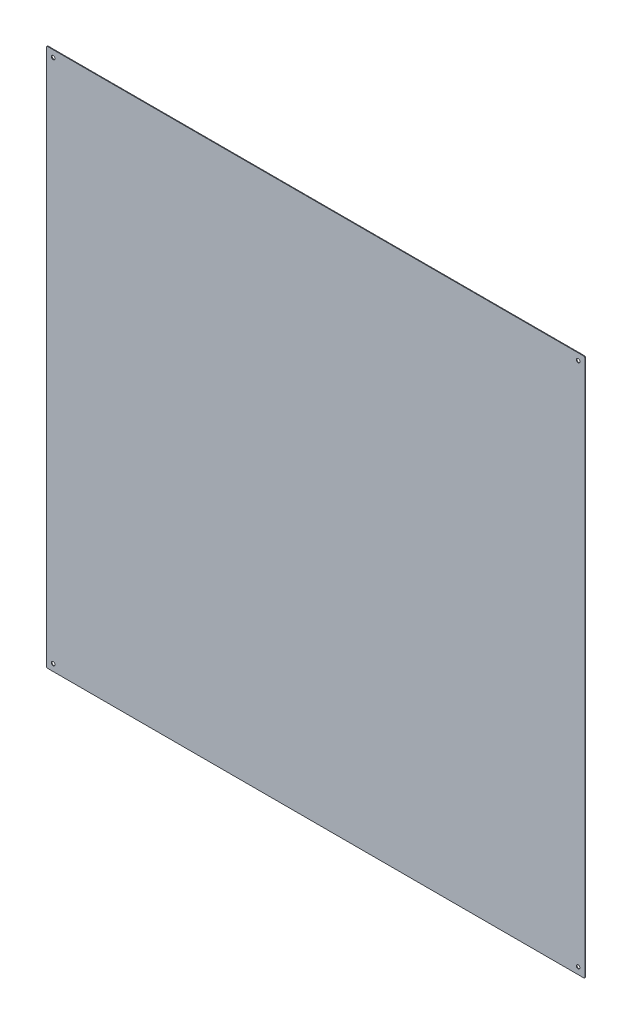
ISO-10303-21;
HEADER;
FILE_DESCRIPTION(('STEP AP214'),'2;1');
FILE_NAME('part.step','',(''),(''),'','','');
FILE_SCHEMA(('AUTOMOTIVE_DESIGN { 1 0 10303 214 1 1 1 1 }'));
ENDSEC;
DATA;
#1=APPLICATION_CONTEXT('core data for automotive mechanical design processes');
#2=APPLICATION_PROTOCOL_DEFINITION('international standard','automotive_design',2000,#1);
#3=PRODUCT_CONTEXT('',#1,'mechanical');
#4=PRODUCT('Part','Part','',(#3));
#5=PRODUCT_RELATED_PRODUCT_CATEGORY('part','',(#4));
#6=PRODUCT_DEFINITION_FORMATION('','',#4);
#7=PRODUCT_DEFINITION_CONTEXT('part definition',#1,'design');
#8=PRODUCT_DEFINITION('design','',#6,#7);
#9=PRODUCT_DEFINITION_SHAPE('','',#8);
#10=(LENGTH_UNIT() NAMED_UNIT(*) SI_UNIT(.MILLI.,.METRE.));
#11=(NAMED_UNIT(*) PLANE_ANGLE_UNIT() SI_UNIT($,.RADIAN.));
#12=(NAMED_UNIT(*) SI_UNIT($,.STERADIAN.) SOLID_ANGLE_UNIT());
#13=UNCERTAINTY_MEASURE_WITH_UNIT(LENGTH_MEASURE(1.E-05),#10,'distance_accuracy_value','');
#14=(GEOMETRIC_REPRESENTATION_CONTEXT(3) GLOBAL_UNCERTAINTY_ASSIGNED_CONTEXT((#13)) GLOBAL_UNIT_ASSIGNED_CONTEXT((#10,
#11,#12)) REPRESENTATION_CONTEXT('',''));
#15=CARTESIAN_POINT('',(0.,0.,0.));
#16=DIRECTION('',(0.,0.,1.));
#17=DIRECTION('',(1.,0.,0.));
#18=AXIS2_PLACEMENT_3D('',#15,#16,#17);
#19=CARTESIAN_POINT('',(0.,0.,6.00000000000001));
#20=DIRECTION('',(0.,0.,1.));
#21=DIRECTION('',(1.,0.,0.));
#22=AXIS2_PLACEMENT_3D('',#19,#20,#21);
#23=PLANE('',#22);
#24=CARTESIAN_POINT('',(-599.5,599.5,6.00000000000001));
#25=DIRECTION('',(0.,0.,-1.));
#26=DIRECTION('',(-1.,0.,0.));
#27=AXIS2_PLACEMENT_3D('',#24,#25,#26);
#28=CIRCLE('',#27,3.);
#29=CARTESIAN_POINT('',(-599.5,602.5,6.00000000000001));
#30=VERTEX_POINT('',#29);
#31=CARTESIAN_POINT('',(-602.5,599.5,6.00000000000001));
#32=VERTEX_POINT('',#31);
#33=EDGE_CURVE('E85',#30,#32,#28,.F.);
#34=ORIENTED_EDGE('',*,*,#33,.F.);
#35=DIRECTION('',(1.,0.,0.));
#36=VECTOR('',#35,1.);
#37=CARTESIAN_POINT('',(-602.5,602.5,6.00000000000001));
#38=LINE('',#37,#36);
#39=CARTESIAN_POINT('',(599.500000000001,602.5,6.00000000000001));
#40=VERTEX_POINT('',#39);
#41=EDGE_CURVE('E77',#30,#40,#38,.T.);
#42=ORIENTED_EDGE('',*,*,#41,.T.);
#43=CARTESIAN_POINT('',(599.500000000001,599.5,6.00000000000001));
#44=DIRECTION('',(0.,0.,-1.));
#45=DIRECTION('',(-1.,0.,0.));
#46=AXIS2_PLACEMENT_3D('',#43,#44,#45);
#47=CIRCLE('',#46,3.);
#48=CARTESIAN_POINT('',(602.500000000001,599.5,6.00000000000001));
#49=VERTEX_POINT('',#48);
#50=EDGE_CURVE('E143',#49,#40,#47,.F.);
#51=ORIENTED_EDGE('',*,*,#50,.F.);
#52=DIRECTION('',(0.,-1.,0.));
#53=VECTOR('',#52,1.);
#54=CARTESIAN_POINT('',(602.500000000001,602.5,6.00000000000001));
#55=LINE('',#54,#53);
#56=CARTESIAN_POINT('',(602.500000000001,-599.5,6.00000000000001));
#57=VERTEX_POINT('',#56);
#58=EDGE_CURVE('E112',#49,#57,#55,.T.);
#59=ORIENTED_EDGE('',*,*,#58,.T.);
#60=CARTESIAN_POINT('',(599.500000000001,-599.5,6.00000000000001));
#61=DIRECTION('',(0.,0.,-1.));
#62=DIRECTION('',(-1.,0.,0.));
#63=AXIS2_PLACEMENT_3D('',#60,#61,#62);
#64=CIRCLE('',#63,3.);
#65=CARTESIAN_POINT('',(599.500000000001,-602.5,6.00000000000001));
#66=VERTEX_POINT('',#65);
#67=EDGE_CURVE('E146',#66,#57,#64,.F.);
#68=ORIENTED_EDGE('',*,*,#67,.F.);
#69=DIRECTION('',(1.,0.,0.));
#70=VECTOR('',#69,1.);
#71=CARTESIAN_POINT('',(-602.499999999999,-602.5,6.00000000000001));
#72=LINE('',#71,#70);
#73=CARTESIAN_POINT('',(-599.499999999999,-602.5,6.00000000000001));
#74=VERTEX_POINT('',#73);
#75=EDGE_CURVE('E116',#66,#74,#72,.F.);
#76=ORIENTED_EDGE('',*,*,#75,.T.);
#77=CARTESIAN_POINT('',(-599.499999999999,-599.5,6.00000000000001));
#78=DIRECTION('',(0.,0.,-1.));
#79=DIRECTION('',(-1.,0.,0.));
#80=AXIS2_PLACEMENT_3D('',#77,#78,#79);
#81=CIRCLE('',#80,3.);
#82=CARTESIAN_POINT('',(-602.499999999999,-599.5,6.00000000000001));
#83=VERTEX_POINT('',#82);
#84=EDGE_CURVE('E88',#83,#74,#81,.F.);
#85=ORIENTED_EDGE('',*,*,#84,.F.);
#86=DIRECTION('',(0.,1.,0.));
#87=VECTOR('',#86,1.);
#88=CARTESIAN_POINT('',(-602.5,602.5,6.00000000000001));
#89=LINE('',#88,#87);
#90=EDGE_CURVE('E82',#83,#32,#89,.T.);
#91=ORIENTED_EDGE('',*,*,#90,.T.);
#92=EDGE_LOOP('',(#34,#42,#51,#59,#68,#76,#85,#91));
#93=FACE_BOUND('',#92,.T.);
#94=CARTESIAN_POINT('',(-587.322330470334,-587.322330470338,6.00000000000001));
#95=DIRECTION('',(0.,0.,-1.));
#96=DIRECTION('',(-1.,0.,0.));
#97=AXIS2_PLACEMENT_3D('',#94,#95,#96);
#98=CIRCLE('',#97,4.);
#99=CARTESIAN_POINT('',(-591.322330470334,-587.322330470338,6.00000000000001));
#100=VERTEX_POINT('',#99);
#101=EDGE_CURVE('E111',#100,#100,#98,.F.);
#102=ORIENTED_EDGE('',*,*,#101,.T.);
#103=EDGE_LOOP('',(#102));
#104=FACE_BOUND('',#103,.T.);
#105=CARTESIAN_POINT('',(587.322330470341,-587.322330470332,6.00000000000001));
#106=DIRECTION('',(0.,0.,-1.));
#107=DIRECTION('',(-1.,0.,0.));
#108=AXIS2_PLACEMENT_3D('',#105,#106,#107);
#109=CIRCLE('',#108,4.);
#110=CARTESIAN_POINT('',(583.32233047034,-587.322330470332,6.00000000000001));
#111=VERTEX_POINT('',#110);
#112=EDGE_CURVE('E151',#111,#111,#109,.F.);
#113=ORIENTED_EDGE('',*,*,#112,.T.);
#114=EDGE_LOOP('',(#113));
#115=FACE_BOUND('',#114,.T.);
#116=CARTESIAN_POINT('',(587.32233047033,587.322330470342,6.00000000000001));
#117=DIRECTION('',(0.,0.,-1.));
#118=DIRECTION('',(-1.,0.,0.));
#119=AXIS2_PLACEMENT_3D('',#116,#117,#118);
#120=CIRCLE('',#119,4.);
#121=CARTESIAN_POINT('',(583.32233047033,587.322330470342,6.00000000000001));
#122=VERTEX_POINT('',#121);
#123=EDGE_CURVE('E153',#122,#122,#120,.F.);
#124=ORIENTED_EDGE('',*,*,#123,.T.);
#125=EDGE_LOOP('',(#124));
#126=FACE_BOUND('',#125,.T.);
#127=CARTESIAN_POINT('',(-587.322330470337,587.322330470336,6.00000000000001));
#128=DIRECTION('',(0.,0.,-1.));
#129=DIRECTION('',(-1.,0.,0.));
#130=AXIS2_PLACEMENT_3D('',#127,#128,#129);
#131=CIRCLE('',#130,4.);
#132=CARTESIAN_POINT('',(-591.322330470337,587.322330470336,6.00000000000001));
#133=VERTEX_POINT('',#132);
#134=EDGE_CURVE('E19',#133,#133,#131,.F.);
#135=ORIENTED_EDGE('',*,*,#134,.T.);
#136=EDGE_LOOP('',(#135));
#137=FACE_BOUND('',#136,.T.);
#138=ADVANCED_FACE('F16',(#93,#104,#115,#126,#137),#23,.F.);
#139=CARTESIAN_POINT('',(-587.322330470337,587.322330470336,7.50000000000006));
#140=DIRECTION('',(0.,0.,-1.));
#141=DIRECTION('',(-1.,0.,0.));
#142=AXIS2_PLACEMENT_3D('',#139,#140,#141);
#143=CYLINDRICAL_SURFACE('',#142,4.);
#144=ORIENTED_EDGE('',*,*,#134,.F.);
#145=EDGE_LOOP('',(#144));
#146=FACE_BOUND('',#145,.T.);
#147=CARTESIAN_POINT('',(-587.322330470337,587.322330470336,7.50000000000006));
#148=DIRECTION('',(0.,0.,-1.));
#149=DIRECTION('',(-1.,0.,0.));
#150=AXIS2_PLACEMENT_3D('',#147,#148,#149);
#151=CIRCLE('',#150,4.);
#152=CARTESIAN_POINT('',(-591.322330470337,587.322330470336,7.50000000000006));
#153=VERTEX_POINT('',#152);
#154=EDGE_CURVE('E139',#153,#153,#151,.T.);
#155=ORIENTED_EDGE('',*,*,#154,.F.);
#156=EDGE_LOOP('',(#155));
#157=FACE_BOUND('',#156,.T.);
#158=ADVANCED_FACE('F161',(#146,#157),#143,.F.);
#159=CARTESIAN_POINT('',(587.32233047033,587.322330470342,7.50000000000006));
#160=DIRECTION('',(0.,0.,-1.));
#161=DIRECTION('',(-1.,0.,0.));
#162=AXIS2_PLACEMENT_3D('',#159,#160,#161);
#163=CYLINDRICAL_SURFACE('',#162,4.);
#164=ORIENTED_EDGE('',*,*,#123,.F.);
#165=EDGE_LOOP('',(#164));
#166=FACE_BOUND('',#165,.T.);
#167=CARTESIAN_POINT('',(587.32233047033,587.322330470342,7.50000000000006));
#168=DIRECTION('',(0.,0.,-1.));
#169=DIRECTION('',(-1.,0.,0.));
#170=AXIS2_PLACEMENT_3D('',#167,#168,#169);
#171=CIRCLE('',#170,4.);
#172=CARTESIAN_POINT('',(583.32233047033,587.322330470342,7.50000000000006));
#173=VERTEX_POINT('',#172);
#174=EDGE_CURVE('E136',#173,#173,#171,.T.);
#175=ORIENTED_EDGE('',*,*,#174,.F.);
#176=EDGE_LOOP('',(#175));
#177=FACE_BOUND('',#176,.T.);
#178=ADVANCED_FACE('F164',(#166,#177),#163,.F.);
#179=CARTESIAN_POINT('',(587.322330470341,-587.322330470332,7.50000000000006));
#180=DIRECTION('',(0.,0.,-1.));
#181=DIRECTION('',(-1.,0.,0.));
#182=AXIS2_PLACEMENT_3D('',#179,#180,#181);
#183=CYLINDRICAL_SURFACE('',#182,4.);
#184=ORIENTED_EDGE('',*,*,#112,.F.);
#185=EDGE_LOOP('',(#184));
#186=FACE_BOUND('',#185,.T.);
#187=CARTESIAN_POINT('',(587.322330470341,-587.322330470332,7.50000000000006));
#188=DIRECTION('',(0.,0.,-1.));
#189=DIRECTION('',(-1.,0.,0.));
#190=AXIS2_PLACEMENT_3D('',#187,#188,#189);
#191=CIRCLE('',#190,4.);
#192=CARTESIAN_POINT('',(583.32233047034,-587.322330470332,7.50000000000006));
#193=VERTEX_POINT('',#192);
#194=EDGE_CURVE('E133',#193,#193,#191,.T.);
#195=ORIENTED_EDGE('',*,*,#194,.F.);
#196=EDGE_LOOP('',(#195));
#197=FACE_BOUND('',#196,.T.);
#198=ADVANCED_FACE('F206',(#186,#197),#183,.F.);
#199=CARTESIAN_POINT('',(-587.322330470334,-587.322330470338,7.50000000000006));
#200=DIRECTION('',(0.,0.,-1.));
#201=DIRECTION('',(-1.,0.,0.));
#202=AXIS2_PLACEMENT_3D('',#199,#200,#201);
#203=CYLINDRICAL_SURFACE('',#202,4.);
#204=ORIENTED_EDGE('',*,*,#101,.F.);
#205=EDGE_LOOP('',(#204));
#206=FACE_BOUND('',#205,.T.);
#207=CARTESIAN_POINT('',(-587.322330470334,-587.322330470338,7.50000000000006));
#208=DIRECTION('',(0.,0.,-1.));
#209=DIRECTION('',(-1.,0.,0.));
#210=AXIS2_PLACEMENT_3D('',#207,#208,#209);
#211=CIRCLE('',#210,4.);
#212=CARTESIAN_POINT('',(-591.322330470334,-587.322330470338,7.50000000000006));
#213=VERTEX_POINT('',#212);
#214=EDGE_CURVE('E130',#213,#213,#211,.T.);
#215=ORIENTED_EDGE('',*,*,#214,.F.);
#216=EDGE_LOOP('',(#215));
#217=FACE_BOUND('',#216,.T.);
#218=ADVANCED_FACE('F203',(#206,#217),#203,.F.);
#219=CARTESIAN_POINT('',(-602.5,602.5,7.50000000000006));
#220=DIRECTION('',(0.,-1.,0.));
#221=DIRECTION('',(1.,0.,0.));
#222=AXIS2_PLACEMENT_3D('',#219,#220,#221);
#223=PLANE('',#222);
#224=DIRECTION('',(0.,0.,-1.));
#225=VECTOR('',#224,1.);
#226=CARTESIAN_POINT('',(-599.5,602.5,7.50000000000006));
#227=LINE('',#226,#225);
#228=CARTESIAN_POINT('',(-599.5,602.5,7.50000000000006));
#229=VERTEX_POINT('',#228);
#230=EDGE_CURVE('E98',#229,#30,#227,.T.);
#231=ORIENTED_EDGE('',*,*,#230,.F.);
#232=DIRECTION('',(1.,0.,0.));
#233=VECTOR('',#232,1.);
#234=CARTESIAN_POINT('',(0.,602.5,7.50000000000006));
#235=LINE('',#234,#233);
#236=CARTESIAN_POINT('',(599.500000000001,602.5,7.50000000000006));
#237=VERTEX_POINT('',#236);
#238=EDGE_CURVE('E129',#237,#229,#235,.F.);
#239=ORIENTED_EDGE('',*,*,#238,.F.);
#240=DIRECTION('',(0.,0.,-1.));
#241=VECTOR('',#240,1.);
#242=CARTESIAN_POINT('',(599.500000000001,602.5,7.50000000000006));
#243=LINE('',#242,#241);
#244=EDGE_CURVE('E142',#40,#237,#243,.F.);
#245=ORIENTED_EDGE('',*,*,#244,.F.);
#246=ORIENTED_EDGE('',*,*,#41,.F.);
#247=EDGE_LOOP('',(#231,#239,#245,#246));
#248=FACE_BOUND('',#247,.T.);
#249=ADVANCED_FACE('F200',(#248),#223,.F.);
#250=CARTESIAN_POINT('',(-599.5,599.5,7.50000000000006));
#251=DIRECTION('',(0.,0.,-1.));
#252=DIRECTION('',(-1.,0.,0.));
#253=AXIS2_PLACEMENT_3D('',#250,#251,#252);
#254=CYLINDRICAL_SURFACE('',#253,3.);
#255=ORIENTED_EDGE('',*,*,#33,.T.);
#256=DIRECTION('',(0.,0.,1.));
#257=VECTOR('',#256,1.);
#258=CARTESIAN_POINT('',(-602.5,599.5,7.50000000000006));
#259=LINE('',#258,#257);
#260=CARTESIAN_POINT('',(-602.5,599.5,7.50000000000006));
#261=VERTEX_POINT('',#260);
#262=EDGE_CURVE('E92',#32,#261,#259,.T.);
#263=ORIENTED_EDGE('',*,*,#262,.T.);
#264=CARTESIAN_POINT('',(-599.5,599.5,7.50000000000006));
#265=DIRECTION('',(0.,0.,-1.));
#266=DIRECTION('',(-1.,0.,0.));
#267=AXIS2_PLACEMENT_3D('',#264,#265,#266);
#268=CIRCLE('',#267,3.);
#269=EDGE_CURVE('E127',#229,#261,#268,.F.);
#270=ORIENTED_EDGE('',*,*,#269,.F.);
#271=ORIENTED_EDGE('',*,*,#230,.T.);
#272=EDGE_LOOP('',(#255,#263,#270,#271));
#273=FACE_BOUND('',#272,.T.);
#274=ADVANCED_FACE('F95',(#273),#254,.T.);
#275=CARTESIAN_POINT('',(-602.5,602.5,7.50000000000006));
#276=DIRECTION('',(1.,0.,0.));
#277=DIRECTION('',(0.,1.,0.));
#278=AXIS2_PLACEMENT_3D('',#275,#276,#277);
#279=PLANE('',#278);
#280=ORIENTED_EDGE('',*,*,#262,.F.);
#281=ORIENTED_EDGE('',*,*,#90,.F.);
#282=DIRECTION('',(0.,0.,-1.));
#283=VECTOR('',#282,1.);
#284=CARTESIAN_POINT('',(-602.499999999999,-599.5,7.50000000000006));
#285=LINE('',#284,#283);
#286=CARTESIAN_POINT('',(-602.499999999999,-599.5,7.50000000000006));
#287=VERTEX_POINT('',#286);
#288=EDGE_CURVE('E104',#287,#83,#285,.T.);
#289=ORIENTED_EDGE('',*,*,#288,.F.);
#290=DIRECTION('',(0.,1.,0.));
#291=VECTOR('',#290,1.);
#292=CARTESIAN_POINT('',(-602.5,0.,7.50000000000006));
#293=LINE('',#292,#291);
#294=EDGE_CURVE('E102',#261,#287,#293,.F.);
#295=ORIENTED_EDGE('',*,*,#294,.F.);
#296=EDGE_LOOP('',(#280,#281,#289,#295));
#297=FACE_BOUND('',#296,.T.);
#298=ADVANCED_FACE('F100',(#297),#279,.F.);
#299=CARTESIAN_POINT('',(-599.499999999999,-599.5,7.50000000000006));
#300=DIRECTION('',(0.,0.,-1.));
#301=DIRECTION('',(-1.,0.,0.));
#302=AXIS2_PLACEMENT_3D('',#299,#300,#301);
#303=CYLINDRICAL_SURFACE('',#302,3.);
#304=ORIENTED_EDGE('',*,*,#84,.T.);
#305=DIRECTION('',(0.,0.,1.));
#306=VECTOR('',#305,1.);
#307=CARTESIAN_POINT('',(-599.499999999999,-602.5,7.50000000000006));
#308=LINE('',#307,#306);
#309=CARTESIAN_POINT('',(-599.499999999999,-602.5,7.50000000000006));
#310=VERTEX_POINT('',#309);
#311=EDGE_CURVE('E118',#74,#310,#308,.T.);
#312=ORIENTED_EDGE('',*,*,#311,.T.);
#313=CARTESIAN_POINT('',(-599.499999999999,-599.5,7.50000000000006));
#314=DIRECTION('',(0.,0.,-1.));
#315=DIRECTION('',(-1.,0.,0.));
#316=AXIS2_PLACEMENT_3D('',#313,#314,#315);
#317=CIRCLE('',#316,3.);
#318=EDGE_CURVE('E124',#287,#310,#317,.F.);
#319=ORIENTED_EDGE('',*,*,#318,.F.);
#320=ORIENTED_EDGE('',*,*,#288,.T.);
#321=EDGE_LOOP('',(#304,#312,#319,#320));
#322=FACE_BOUND('',#321,.T.);
#323=ADVANCED_FACE('F191',(#322),#303,.T.);
#324=CARTESIAN_POINT('',(-602.499999999999,-602.5,7.50000000000006));
#325=DIRECTION('',(0.,1.,0.));
#326=DIRECTION('',(0.,0.,1.));
#327=AXIS2_PLACEMENT_3D('',#324,#325,#326);
#328=PLANE('',#327);
#329=DIRECTION('',(0.,0.,-1.));
#330=VECTOR('',#329,1.);
#331=CARTESIAN_POINT('',(599.500000000001,-602.5,7.50000000000006));
#332=LINE('',#331,#330);
#333=CARTESIAN_POINT('',(599.500000000001,-602.5,7.50000000000006));
#334=VERTEX_POINT('',#333);
#335=EDGE_CURVE('E117',#334,#66,#332,.T.);
#336=ORIENTED_EDGE('',*,*,#335,.F.);
#337=DIRECTION('',(1.,0.,0.));
#338=VECTOR('',#337,1.);
#339=CARTESIAN_POINT('',(0.,-602.5,7.50000000000006));
#340=LINE('',#339,#338);
#341=EDGE_CURVE('E123',#310,#334,#340,.T.);
#342=ORIENTED_EDGE('',*,*,#341,.F.);
#343=ORIENTED_EDGE('',*,*,#311,.F.);
#344=ORIENTED_EDGE('',*,*,#75,.F.);
#345=EDGE_LOOP('',(#336,#342,#343,#344));
#346=FACE_BOUND('',#345,.T.);
#347=ADVANCED_FACE('F187',(#346),#328,.F.);
#348=CARTESIAN_POINT('',(599.500000000001,-599.5,7.50000000000006));
#349=DIRECTION('',(0.,0.,-1.));
#350=DIRECTION('',(-1.,0.,0.));
#351=AXIS2_PLACEMENT_3D('',#348,#349,#350);
#352=CYLINDRICAL_SURFACE('',#351,3.);
#353=ORIENTED_EDGE('',*,*,#67,.T.);
#354=DIRECTION('',(0.,0.,1.));
#355=VECTOR('',#354,1.);
#356=CARTESIAN_POINT('',(602.500000000001,-599.5,7.50000000000006));
#357=LINE('',#356,#355);
#358=CARTESIAN_POINT('',(602.500000000001,-599.5,7.50000000000006));
#359=VERTEX_POINT('',#358);
#360=EDGE_CURVE('E115',#57,#359,#357,.T.);
#361=ORIENTED_EDGE('',*,*,#360,.T.);
#362=CARTESIAN_POINT('',(599.500000000001,-599.5,7.50000000000006));
#363=DIRECTION('',(0.,0.,-1.));
#364=DIRECTION('',(-1.,0.,0.));
#365=AXIS2_PLACEMENT_3D('',#362,#363,#364);
#366=CIRCLE('',#365,3.);
#367=EDGE_CURVE('E120',#334,#359,#366,.F.);
#368=ORIENTED_EDGE('',*,*,#367,.F.);
#369=ORIENTED_EDGE('',*,*,#335,.T.);
#370=EDGE_LOOP('',(#353,#361,#368,#369));
#371=FACE_BOUND('',#370,.T.);
#372=ADVANCED_FACE('F184',(#371),#352,.T.);
#373=CARTESIAN_POINT('',(602.500000000001,602.5,7.50000000000006));
#374=DIRECTION('',(-1.,0.,0.));
#375=DIRECTION('',(0.,-1.,0.));
#376=AXIS2_PLACEMENT_3D('',#373,#374,#375);
#377=PLANE('',#376);
#378=DIRECTION('',(0.,0.,-1.));
#379=VECTOR('',#378,1.);
#380=CARTESIAN_POINT('',(602.500000000001,599.5,7.50000000000006));
#381=LINE('',#380,#379);
#382=CARTESIAN_POINT('',(602.500000000001,599.5,7.50000000000006));
#383=VERTEX_POINT('',#382);
#384=EDGE_CURVE('E34',#383,#49,#381,.T.);
#385=ORIENTED_EDGE('',*,*,#384,.F.);
#386=DIRECTION('',(0.,1.,0.));
#387=VECTOR('',#386,1.);
#388=CARTESIAN_POINT('',(602.500000000001,0.,7.50000000000006));
#389=LINE('',#388,#387);
#390=EDGE_CURVE('E25',#359,#383,#389,.T.);
#391=ORIENTED_EDGE('',*,*,#390,.F.);
#392=ORIENTED_EDGE('',*,*,#360,.F.);
#393=ORIENTED_EDGE('',*,*,#58,.F.);
#394=EDGE_LOOP('',(#385,#391,#392,#393));
#395=FACE_BOUND('',#394,.T.);
#396=ADVANCED_FACE('F176',(#395),#377,.F.);
#397=CARTESIAN_POINT('',(599.500000000001,599.5,7.50000000000006));
#398=DIRECTION('',(0.,0.,-1.));
#399=DIRECTION('',(-1.,0.,0.));
#400=AXIS2_PLACEMENT_3D('',#397,#398,#399);
#401=CYLINDRICAL_SURFACE('',#400,3.);
#402=ORIENTED_EDGE('',*,*,#50,.T.);
#403=ORIENTED_EDGE('',*,*,#244,.T.);
#404=CARTESIAN_POINT('',(599.500000000001,599.5,7.50000000000006));
#405=DIRECTION('',(0.,0.,-1.));
#406=DIRECTION('',(-1.,0.,0.));
#407=AXIS2_PLACEMENT_3D('',#404,#405,#406);
#408=CIRCLE('',#407,3.);
#409=EDGE_CURVE('E11',#383,#237,#408,.F.);
#410=ORIENTED_EDGE('',*,*,#409,.F.);
#411=ORIENTED_EDGE('',*,*,#384,.T.);
#412=EDGE_LOOP('',(#402,#403,#410,#411));
#413=FACE_BOUND('',#412,.T.);
#414=ADVANCED_FACE('F169',(#413),#401,.T.);
#415=CARTESIAN_POINT('',(0.,0.,7.50000000000006));
#416=DIRECTION('',(0.,0.,1.));
#417=DIRECTION('',(1.,0.,0.));
#418=AXIS2_PLACEMENT_3D('',#415,#416,#417);
#419=PLANE('',#418);
#420=ORIENTED_EDGE('',*,*,#390,.T.);
#421=ORIENTED_EDGE('',*,*,#409,.T.);
#422=ORIENTED_EDGE('',*,*,#238,.T.);
#423=ORIENTED_EDGE('',*,*,#269,.T.);
#424=ORIENTED_EDGE('',*,*,#294,.T.);
#425=ORIENTED_EDGE('',*,*,#318,.T.);
#426=ORIENTED_EDGE('',*,*,#341,.T.);
#427=ORIENTED_EDGE('',*,*,#367,.T.);
#428=EDGE_LOOP('',(#420,#421,#422,#423,#424,#425,#426,#427));
#429=FACE_BOUND('',#428,.T.);
#430=ORIENTED_EDGE('',*,*,#214,.T.);
#431=EDGE_LOOP('',(#430));
#432=FACE_BOUND('',#431,.T.);
#433=ORIENTED_EDGE('',*,*,#194,.T.);
#434=EDGE_LOOP('',(#433));
#435=FACE_BOUND('',#434,.T.);
#436=ORIENTED_EDGE('',*,*,#174,.T.);
#437=EDGE_LOOP('',(#436));
#438=FACE_BOUND('',#437,.T.);
#439=ORIENTED_EDGE('',*,*,#154,.T.);
#440=EDGE_LOOP('',(#439));
#441=FACE_BOUND('',#440,.T.);
#442=ADVANCED_FACE('F167',(#429,#432,#435,#438,#441),#419,.T.);
#443=CLOSED_SHELL('',(#138,#158,#178,#198,#218,#249,#274,#298,#323,#347,#372,#396,#414,#442));
#444=MANIFOLD_SOLID_BREP('B1',#443);
#445=ADVANCED_BREP_SHAPE_REPRESENTATION('',(#18,#444),#14);
#446=SHAPE_DEFINITION_REPRESENTATION(#9,#445);
ENDSEC;
END-ISO-10303-21;
